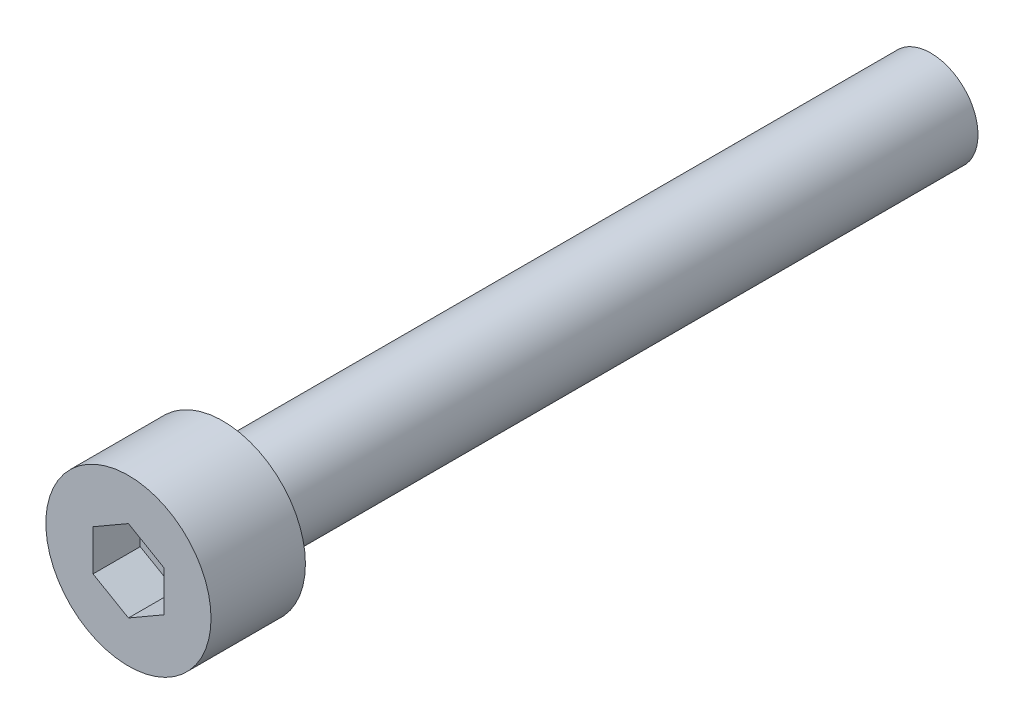
ISO-10303-21;
HEADER;
FILE_DESCRIPTION(('STEP AP214'),'2;1');
FILE_NAME('part.step','',(''),(''),'','','');
FILE_SCHEMA(('AUTOMOTIVE_DESIGN { 1 0 10303 214 1 1 1 1 }'));
ENDSEC;
DATA;
#1=APPLICATION_CONTEXT('core data for automotive mechanical design processes');
#2=APPLICATION_PROTOCOL_DEFINITION('international standard','automotive_design',2000,#1);
#3=PRODUCT_CONTEXT('',#1,'mechanical');
#4=PRODUCT('Part','Part','',(#3));
#5=PRODUCT_RELATED_PRODUCT_CATEGORY('part','',(#4));
#6=PRODUCT_DEFINITION_FORMATION('','',#4);
#7=PRODUCT_DEFINITION_CONTEXT('part definition',#1,'design');
#8=PRODUCT_DEFINITION('design','',#6,#7);
#9=PRODUCT_DEFINITION_SHAPE('','',#8);
#10=(LENGTH_UNIT() NAMED_UNIT(*) SI_UNIT(.MILLI.,.METRE.));
#11=(NAMED_UNIT(*) PLANE_ANGLE_UNIT() SI_UNIT($,.RADIAN.));
#12=(NAMED_UNIT(*) SI_UNIT($,.STERADIAN.) SOLID_ANGLE_UNIT());
#13=UNCERTAINTY_MEASURE_WITH_UNIT(LENGTH_MEASURE(1.E-05),#10,'distance_accuracy_value','');
#14=(GEOMETRIC_REPRESENTATION_CONTEXT(3) GLOBAL_UNCERTAINTY_ASSIGNED_CONTEXT((#13)) GLOBAL_UNIT_ASSIGNED_CONTEXT((#10,
#11,#12)) REPRESENTATION_CONTEXT('',''));
#15=CARTESIAN_POINT('',(0.,0.,0.));
#16=DIRECTION('',(0.,0.,1.));
#17=DIRECTION('',(1.,0.,0.));
#18=AXIS2_PLACEMENT_3D('',#15,#16,#17);
#19=CARTESIAN_POINT('',(0.,0.,0.));
#20=DIRECTION('',(0.,0.,1.));
#21=DIRECTION('',(1.,0.,0.));
#22=AXIS2_PLACEMENT_3D('',#19,#20,#21);
#23=PLANE('',#22);
#24=CARTESIAN_POINT('',(0.,0.,0.));
#25=DIRECTION('',(0.,0.,1.));
#26=DIRECTION('',(1.,0.,0.));
#27=AXIS2_PLACEMENT_3D('',#24,#25,#26);
#28=CIRCLE('',#27,3.5);
#29=CARTESIAN_POINT('',(3.5,0.,0.));
#30=VERTEX_POINT('',#29);
#31=EDGE_CURVE('E135',#30,#30,#28,.T.);
#32=ORIENTED_EDGE('',*,*,#31,.F.);
#33=EDGE_LOOP('',(#32));
#34=FACE_BOUND('',#33,.T.);
#35=CARTESIAN_POINT('',(0.,0.,0.));
#36=DIRECTION('',(0.,0.,1.));
#37=DIRECTION('',(1.,0.,0.));
#38=AXIS2_PLACEMENT_3D('',#35,#36,#37);
#39=CIRCLE('',#38,2.);
#40=CARTESIAN_POINT('',(2.,0.,0.));
#41=VERTEX_POINT('',#40);
#42=EDGE_CURVE('E11',#41,#41,#39,.F.);
#43=ORIENTED_EDGE('',*,*,#42,.F.);
#44=EDGE_LOOP('',(#43));
#45=FACE_BOUND('',#44,.T.);
#46=ADVANCED_FACE('F32',(#34,#45),#23,.F.);
#47=CARTESIAN_POINT('',(0.,0.,4.));
#48=DIRECTION('',(0.,0.,-1.));
#49=DIRECTION('',(-1.,0.,0.));
#50=AXIS2_PLACEMENT_3D('',#47,#48,#49);
#51=CYLINDRICAL_SURFACE('',#50,3.5);
#52=CARTESIAN_POINT('',(0.,0.,4.));
#53=DIRECTION('',(0.,0.,1.));
#54=DIRECTION('',(1.,0.,0.));
#55=AXIS2_PLACEMENT_3D('',#52,#53,#54);
#56=CIRCLE('',#55,3.5);
#57=CARTESIAN_POINT('',(3.5,0.,4.));
#58=VERTEX_POINT('',#57);
#59=EDGE_CURVE('E40',#58,#58,#56,.T.);
#60=ORIENTED_EDGE('',*,*,#59,.F.);
#61=EDGE_LOOP('',(#60));
#62=FACE_BOUND('',#61,.T.);
#63=ORIENTED_EDGE('',*,*,#31,.T.);
#64=EDGE_LOOP('',(#63));
#65=FACE_BOUND('',#64,.T.);
#66=ADVANCED_FACE('F34',(#62,#65),#51,.T.);
#67=CARTESIAN_POINT('',(0.,0.,4.));
#68=DIRECTION('',(0.,0.,1.));
#69=DIRECTION('',(1.,0.,0.));
#70=AXIS2_PLACEMENT_3D('',#67,#68,#69);
#71=PLANE('',#70);
#72=DIRECTION('',(0.866025403784439,-0.5,0.));
#73=VECTOR('',#72,1.);
#74=CARTESIAN_POINT('',(-1.50000000000001,-0.866025403784446,4.));
#75=LINE('',#74,#73);
#76=CARTESIAN_POINT('',(-1.50000000000001,-0.866025403784446,4.));
#77=VERTEX_POINT('',#76);
#78=CARTESIAN_POINT('',(0.,-1.73205080756889,4.));
#79=VERTEX_POINT('',#78);
#80=EDGE_CURVE('E47',#77,#79,#75,.T.);
#81=ORIENTED_EDGE('',*,*,#80,.F.);
#82=DIRECTION('',(0.,-1.,0.));
#83=VECTOR('',#82,1.);
#84=CARTESIAN_POINT('',(-1.50000000000001,0.866025403784446,4.));
#85=LINE('',#84,#83);
#86=CARTESIAN_POINT('',(-1.50000000000001,0.866025403784446,4.));
#87=VERTEX_POINT('',#86);
#88=EDGE_CURVE('E131',#87,#77,#85,.T.);
#89=ORIENTED_EDGE('',*,*,#88,.F.);
#90=DIRECTION('',(-0.866025403784438,-0.5,0.));
#91=VECTOR('',#90,1.);
#92=CARTESIAN_POINT('',(0.,1.73205080756889,4.));
#93=LINE('',#92,#91);
#94=CARTESIAN_POINT('',(0.,1.73205080756889,4.));
#95=VERTEX_POINT('',#94);
#96=EDGE_CURVE('E129',#95,#87,#93,.T.);
#97=ORIENTED_EDGE('',*,*,#96,.F.);
#98=DIRECTION('',(-0.866025403784439,0.5,0.));
#99=VECTOR('',#98,1.);
#100=CARTESIAN_POINT('',(1.50000000000001,0.866025403784447,4.));
#101=LINE('',#100,#99);
#102=CARTESIAN_POINT('',(1.50000000000001,0.866025403784447,4.));
#103=VERTEX_POINT('',#102);
#104=EDGE_CURVE('E95',#103,#95,#101,.T.);
#105=ORIENTED_EDGE('',*,*,#104,.F.);
#106=DIRECTION('',(0.,1.,0.));
#107=VECTOR('',#106,1.);
#108=CARTESIAN_POINT('',(1.50000000000001,-0.866025403784446,4.));
#109=LINE('',#108,#107);
#110=CARTESIAN_POINT('',(1.50000000000001,-0.866025403784446,4.));
#111=VERTEX_POINT('',#110);
#112=EDGE_CURVE('E125',#111,#103,#109,.T.);
#113=ORIENTED_EDGE('',*,*,#112,.F.);
#114=DIRECTION('',(0.866025403784439,0.5,0.));
#115=VECTOR('',#114,1.);
#116=CARTESIAN_POINT('',(0.,-1.73205080756889,4.));
#117=LINE('',#116,#115);
#118=EDGE_CURVE('E121',#79,#111,#117,.T.);
#119=ORIENTED_EDGE('',*,*,#118,.F.);
#120=EDGE_LOOP('',(#81,#89,#97,#105,#113,#119));
#121=FACE_BOUND('',#120,.T.);
#122=ORIENTED_EDGE('',*,*,#59,.T.);
#123=EDGE_LOOP('',(#122));
#124=FACE_BOUND('',#123,.T.);
#125=ADVANCED_FACE('F182',(#121,#124),#71,.T.);
#126=CARTESIAN_POINT('',(-1.50000000000001,-0.866025403784446,2.));
#127=DIRECTION('',(-0.5,-0.866025403784439,0.));
#128=DIRECTION('',(0.866025403784439,-0.5,0.));
#129=AXIS2_PLACEMENT_3D('',#126,#127,#128);
#130=PLANE('',#129);
#131=ORIENTED_EDGE('',*,*,#80,.T.);
#132=DIRECTION('',(0.,0.,1.));
#133=VECTOR('',#132,1.);
#134=CARTESIAN_POINT('',(0.,-1.73205080756889,2.));
#135=LINE('',#134,#133);
#136=CARTESIAN_POINT('',(0.,-1.73205080756889,2.));
#137=VERTEX_POINT('',#136);
#138=EDGE_CURVE('E77',#137,#79,#135,.T.);
#139=ORIENTED_EDGE('',*,*,#138,.F.);
#140=DIRECTION('',(0.866025403784439,-0.5,0.));
#141=VECTOR('',#140,1.);
#142=CARTESIAN_POINT('',(-1.50000000000001,-0.866025403784446,2.));
#143=LINE('',#142,#141);
#144=CARTESIAN_POINT('',(-1.50000000000001,-0.866025403784446,2.));
#145=VERTEX_POINT('',#144);
#146=EDGE_CURVE('E133',#145,#137,#143,.T.);
#147=ORIENTED_EDGE('',*,*,#146,.F.);
#148=DIRECTION('',(0.,0.,1.));
#149=VECTOR('',#148,1.);
#150=CARTESIAN_POINT('',(-1.50000000000001,-0.866025403784446,2.));
#151=LINE('',#150,#149);
#152=EDGE_CURVE('E55',#145,#77,#151,.T.);
#153=ORIENTED_EDGE('',*,*,#152,.T.);
#154=EDGE_LOOP('',(#131,#139,#147,#153));
#155=FACE_BOUND('',#154,.T.);
#156=ADVANCED_FACE('F168',(#155),#130,.F.);
#157=CARTESIAN_POINT('',(-1.50000000000001,0.866025403784446,2.));
#158=DIRECTION('',(-1.,0.,0.));
#159=DIRECTION('',(0.,-1.,0.));
#160=AXIS2_PLACEMENT_3D('',#157,#158,#159);
#161=PLANE('',#160);
#162=ORIENTED_EDGE('',*,*,#88,.T.);
#163=ORIENTED_EDGE('',*,*,#152,.F.);
#164=DIRECTION('',(0.,-1.,0.));
#165=VECTOR('',#164,1.);
#166=CARTESIAN_POINT('',(-1.50000000000001,0.866025403784446,2.));
#167=LINE('',#166,#165);
#168=CARTESIAN_POINT('',(-1.50000000000001,0.866025403784446,2.));
#169=VERTEX_POINT('',#168);
#170=EDGE_CURVE('E107',#169,#145,#167,.T.);
#171=ORIENTED_EDGE('',*,*,#170,.F.);
#172=DIRECTION('',(0.,0.,1.));
#173=VECTOR('',#172,1.);
#174=CARTESIAN_POINT('',(-1.50000000000001,0.866025403784446,2.));
#175=LINE('',#174,#173);
#176=EDGE_CURVE('E99',#169,#87,#175,.T.);
#177=ORIENTED_EDGE('',*,*,#176,.T.);
#178=EDGE_LOOP('',(#162,#163,#171,#177));
#179=FACE_BOUND('',#178,.T.);
#180=ADVANCED_FACE('F165',(#179),#161,.F.);
#181=CARTESIAN_POINT('',(0.,1.73205080756889,2.));
#182=DIRECTION('',(-0.5,0.866025403784438,0.));
#183=DIRECTION('',(-0.866025403784439,-0.5,0.));
#184=AXIS2_PLACEMENT_3D('',#181,#182,#183);
#185=PLANE('',#184);
#186=ORIENTED_EDGE('',*,*,#96,.T.);
#187=ORIENTED_EDGE('',*,*,#176,.F.);
#188=DIRECTION('',(-0.866025403784438,-0.5,0.));
#189=VECTOR('',#188,1.);
#190=CARTESIAN_POINT('',(0.,1.73205080756889,2.));
#191=LINE('',#190,#189);
#192=CARTESIAN_POINT('',(0.,1.73205080756889,2.));
#193=VERTEX_POINT('',#192);
#194=EDGE_CURVE('E103',#193,#169,#191,.T.);
#195=ORIENTED_EDGE('',*,*,#194,.F.);
#196=DIRECTION('',(0.,0.,1.));
#197=VECTOR('',#196,1.);
#198=CARTESIAN_POINT('',(0.,1.73205080756889,2.));
#199=LINE('',#198,#197);
#200=EDGE_CURVE('E88',#193,#95,#199,.T.);
#201=ORIENTED_EDGE('',*,*,#200,.T.);
#202=EDGE_LOOP('',(#186,#187,#195,#201));
#203=FACE_BOUND('',#202,.T.);
#204=ADVANCED_FACE('F104',(#203),#185,.F.);
#205=CARTESIAN_POINT('',(1.50000000000001,0.866025403784447,2.));
#206=DIRECTION('',(0.5,0.866025403784439,0.));
#207=DIRECTION('',(-0.866025403784439,0.5,0.));
#208=AXIS2_PLACEMENT_3D('',#205,#206,#207);
#209=PLANE('',#208);
#210=ORIENTED_EDGE('',*,*,#104,.T.);
#211=ORIENTED_EDGE('',*,*,#200,.F.);
#212=DIRECTION('',(-0.866025403784439,0.5,0.));
#213=VECTOR('',#212,1.);
#214=CARTESIAN_POINT('',(1.50000000000001,0.866025403784447,2.));
#215=LINE('',#214,#213);
#216=CARTESIAN_POINT('',(1.50000000000001,0.866025403784447,2.));
#217=VERTEX_POINT('',#216);
#218=EDGE_CURVE('E92',#217,#193,#215,.T.);
#219=ORIENTED_EDGE('',*,*,#218,.F.);
#220=DIRECTION('',(0.,0.,1.));
#221=VECTOR('',#220,1.);
#222=CARTESIAN_POINT('',(1.50000000000001,0.866025403784447,2.));
#223=LINE('',#222,#221);
#224=EDGE_CURVE('E100',#217,#103,#223,.T.);
#225=ORIENTED_EDGE('',*,*,#224,.T.);
#226=EDGE_LOOP('',(#210,#211,#219,#225));
#227=FACE_BOUND('',#226,.T.);
#228=ADVANCED_FACE('F90',(#227),#209,.F.);
#229=CARTESIAN_POINT('',(1.50000000000001,-0.866025403784446,2.));
#230=DIRECTION('',(1.,0.,0.));
#231=DIRECTION('',(0.,1.,0.));
#232=AXIS2_PLACEMENT_3D('',#229,#230,#231);
#233=PLANE('',#232);
#234=ORIENTED_EDGE('',*,*,#112,.T.);
#235=ORIENTED_EDGE('',*,*,#224,.F.);
#236=DIRECTION('',(0.,1.,0.));
#237=VECTOR('',#236,1.);
#238=CARTESIAN_POINT('',(1.50000000000001,-0.866025403784446,2.));
#239=LINE('',#238,#237);
#240=CARTESIAN_POINT('',(1.50000000000001,-0.866025403784446,2.));
#241=VERTEX_POINT('',#240);
#242=EDGE_CURVE('E113',#241,#217,#239,.T.);
#243=ORIENTED_EDGE('',*,*,#242,.F.);
#244=DIRECTION('',(0.,0.,1.));
#245=VECTOR('',#244,1.);
#246=CARTESIAN_POINT('',(1.50000000000001,-0.866025403784446,2.));
#247=LINE('',#246,#245);
#248=EDGE_CURVE('E138',#241,#111,#247,.T.);
#249=ORIENTED_EDGE('',*,*,#248,.T.);
#250=EDGE_LOOP('',(#234,#235,#243,#249));
#251=FACE_BOUND('',#250,.T.);
#252=ADVANCED_FACE('F173',(#251),#233,.F.);
#253=CARTESIAN_POINT('',(0.,-1.73205080756889,2.));
#254=DIRECTION('',(0.5,-0.866025403784439,0.));
#255=DIRECTION('',(0.866025403784439,0.5,0.));
#256=AXIS2_PLACEMENT_3D('',#253,#254,#255);
#257=PLANE('',#256);
#258=ORIENTED_EDGE('',*,*,#118,.T.);
#259=ORIENTED_EDGE('',*,*,#248,.F.);
#260=DIRECTION('',(0.866025403784439,0.5,0.));
#261=VECTOR('',#260,1.);
#262=CARTESIAN_POINT('',(0.,-1.73205080756889,2.));
#263=LINE('',#262,#261);
#264=EDGE_CURVE('E115',#137,#241,#263,.T.);
#265=ORIENTED_EDGE('',*,*,#264,.F.);
#266=ORIENTED_EDGE('',*,*,#138,.T.);
#267=EDGE_LOOP('',(#258,#259,#265,#266));
#268=FACE_BOUND('',#267,.T.);
#269=ADVANCED_FACE('F161',(#268),#257,.F.);
#270=CARTESIAN_POINT('',(0.,0.,2.));
#271=DIRECTION('',(0.,0.,1.));
#272=DIRECTION('',(1.,0.,0.));
#273=AXIS2_PLACEMENT_3D('',#270,#271,#272);
#274=PLANE('',#273);
#275=ORIENTED_EDGE('',*,*,#146,.T.);
#276=ORIENTED_EDGE('',*,*,#264,.T.);
#277=ORIENTED_EDGE('',*,*,#242,.T.);
#278=ORIENTED_EDGE('',*,*,#218,.T.);
#279=ORIENTED_EDGE('',*,*,#194,.T.);
#280=ORIENTED_EDGE('',*,*,#170,.T.);
#281=EDGE_LOOP('',(#275,#276,#277,#278,#279,#280));
#282=FACE_BOUND('',#281,.T.);
#283=ADVANCED_FACE('F110',(#282),#274,.T.);
#284=CARTESIAN_POINT('',(0.,0.,-30.));
#285=DIRECTION('',(0.,0.,1.));
#286=DIRECTION('',(1.,0.,0.));
#287=AXIS2_PLACEMENT_3D('',#284,#285,#286);
#288=CYLINDRICAL_SURFACE('',#287,2.);
#289=CARTESIAN_POINT('',(0.,0.,-30.));
#290=DIRECTION('',(0.,0.,-1.));
#291=DIRECTION('',(-1.,0.,0.));
#292=AXIS2_PLACEMENT_3D('',#289,#290,#291);
#293=CIRCLE('',#292,2.);
#294=CARTESIAN_POINT('',(-2.,0.,-30.));
#295=VERTEX_POINT('',#294);
#296=EDGE_CURVE('E122',#295,#295,#293,.T.);
#297=ORIENTED_EDGE('',*,*,#296,.F.);
#298=EDGE_LOOP('',(#297));
#299=FACE_BOUND('',#298,.T.);
#300=ORIENTED_EDGE('',*,*,#42,.T.);
#301=EDGE_LOOP('',(#300));
#302=FACE_BOUND('',#301,.T.);
#303=ADVANCED_FACE('F150',(#299,#302),#288,.T.);
#304=CARTESIAN_POINT('',(0.,0.,-30.));
#305=DIRECTION('',(0.,0.,-1.));
#306=DIRECTION('',(-1.,0.,0.));
#307=AXIS2_PLACEMENT_3D('',#304,#305,#306);
#308=PLANE('',#307);
#309=ORIENTED_EDGE('',*,*,#296,.T.);
#310=EDGE_LOOP('',(#309));
#311=FACE_BOUND('',#310,.T.);
#312=ADVANCED_FACE('F152',(#311),#308,.T.);
#313=CLOSED_SHELL('',(#46,#66,#125,#156,#180,#204,#228,#252,#269,#283,#303,#312));
#314=MANIFOLD_SOLID_BREP('B2',#313);
#315=ADVANCED_BREP_SHAPE_REPRESENTATION('',(#18,#314),#14);
#316=SHAPE_DEFINITION_REPRESENTATION(#9,#315);
ENDSEC;
END-ISO-10303-21;
